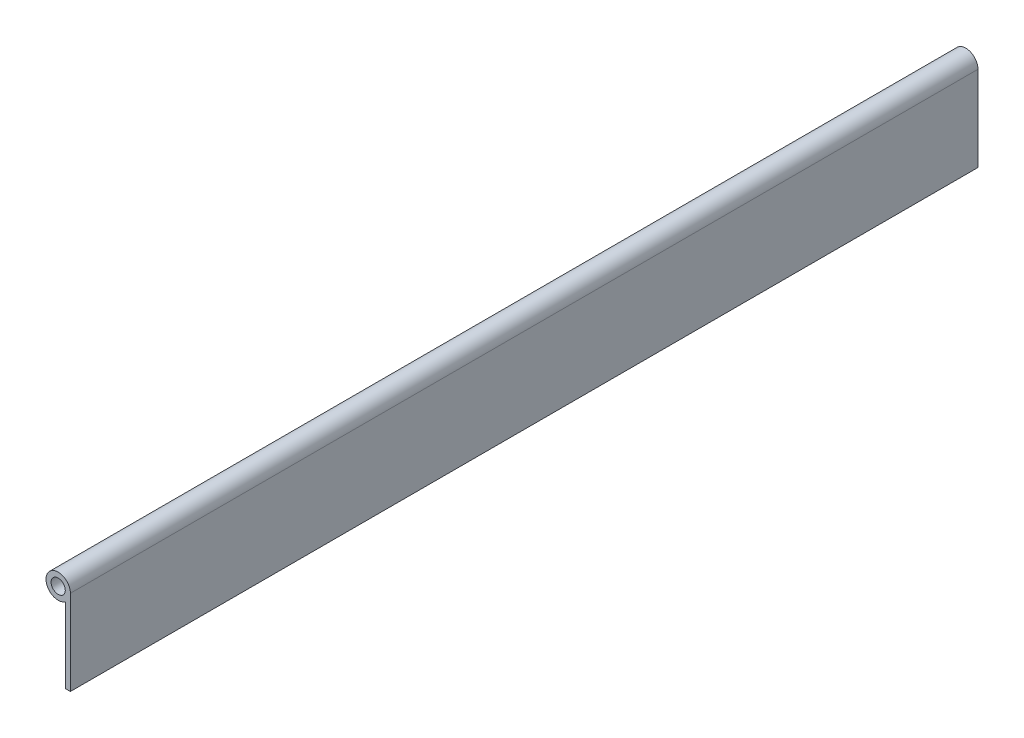
ISO-10303-21;
HEADER;
FILE_DESCRIPTION(('STEP AP214'),'2;1');
FILE_NAME('part.step','',(''),(''),'','','');
FILE_SCHEMA(('AUTOMOTIVE_DESIGN { 1 0 10303 214 1 1 1 1 }'));
ENDSEC;
DATA;
#1=APPLICATION_CONTEXT('core data for automotive mechanical design processes');
#2=APPLICATION_PROTOCOL_DEFINITION('international standard','automotive_design',2000,#1);
#3=PRODUCT_CONTEXT('',#1,'mechanical');
#4=PRODUCT('Part','Part','',(#3));
#5=PRODUCT_RELATED_PRODUCT_CATEGORY('part','',(#4));
#6=PRODUCT_DEFINITION_FORMATION('','',#4);
#7=PRODUCT_DEFINITION_CONTEXT('part definition',#1,'design');
#8=PRODUCT_DEFINITION('design','',#6,#7);
#9=PRODUCT_DEFINITION_SHAPE('','',#8);
#10=(LENGTH_UNIT() NAMED_UNIT(*) SI_UNIT(.MILLI.,.METRE.));
#11=(NAMED_UNIT(*) PLANE_ANGLE_UNIT() SI_UNIT($,.RADIAN.));
#12=(NAMED_UNIT(*) SI_UNIT($,.STERADIAN.) SOLID_ANGLE_UNIT());
#13=UNCERTAINTY_MEASURE_WITH_UNIT(LENGTH_MEASURE(1.E-05),#10,'distance_accuracy_value','');
#14=(GEOMETRIC_REPRESENTATION_CONTEXT(3) GLOBAL_UNCERTAINTY_ASSIGNED_CONTEXT((#13)) GLOBAL_UNIT_ASSIGNED_CONTEXT((#10,
#11,#12)) REPRESENTATION_CONTEXT('',''));
#15=CARTESIAN_POINT('',(0.,0.,0.));
#16=DIRECTION('',(0.,0.,1.));
#17=DIRECTION('',(1.,0.,0.));
#18=AXIS2_PLACEMENT_3D('',#15,#16,#17);
#19=CARTESIAN_POINT('',(0.,0.,406.4));
#20=DIRECTION('',(0.,0.,1.));
#21=DIRECTION('',(1.,0.,0.));
#22=AXIS2_PLACEMENT_3D('',#19,#20,#21);
#23=PLANE('',#22);
#24=CARTESIAN_POINT('',(0.,0.,406.4));
#25=DIRECTION('',(0.,0.,1.));
#26=DIRECTION('',(1.,0.,0.));
#27=AXIS2_PLACEMENT_3D('',#24,#25,#26);
#28=CIRCLE('',#27,5.461);
#29=CARTESIAN_POINT('',(5.461,0.,406.4));
#30=VERTEX_POINT('',#29);
#31=CARTESIAN_POINT('',(3.17500000000001,-4.44318534387211,406.4));
#32=VERTEX_POINT('',#31);
#33=EDGE_CURVE('E89',#30,#32,#28,.T.);
#34=ORIENTED_EDGE('',*,*,#33,.T.);
#35=DIRECTION('',(0.,-1.,0.));
#36=VECTOR('',#35,1.);
#37=CARTESIAN_POINT('',(3.17500000000001,-38.1,406.4));
#38=LINE('',#37,#36);
#39=CARTESIAN_POINT('',(3.17500000000001,-38.1,406.4));
#40=VERTEX_POINT('',#39);
#41=EDGE_CURVE('E84',#32,#40,#38,.T.);
#42=ORIENTED_EDGE('',*,*,#41,.T.);
#43=DIRECTION('',(1.,0.,0.));
#44=VECTOR('',#43,1.);
#45=CARTESIAN_POINT('',(5.461,-38.1,406.4));
#46=LINE('',#45,#44);
#47=CARTESIAN_POINT('',(5.461,-38.1,406.4));
#48=VERTEX_POINT('',#47);
#49=EDGE_CURVE('E87',#40,#48,#46,.T.);
#50=ORIENTED_EDGE('',*,*,#49,.T.);
#51=DIRECTION('',(0.,1.,0.));
#52=VECTOR('',#51,1.);
#53=CARTESIAN_POINT('',(5.461,0.,406.4));
#54=LINE('',#53,#52);
#55=EDGE_CURVE('E54',#48,#30,#54,.T.);
#56=ORIENTED_EDGE('',*,*,#55,.T.);
#57=EDGE_LOOP('',(#34,#42,#50,#56));
#58=FACE_BOUND('',#57,.T.);
#59=CARTESIAN_POINT('',(0.,0.,406.4));
#60=DIRECTION('',(0.,0.,1.));
#61=DIRECTION('',(1.,0.,0.));
#62=AXIS2_PLACEMENT_3D('',#59,#60,#61);
#63=CIRCLE('',#62,3.175);
#64=CARTESIAN_POINT('',(3.175,0.,406.4));
#65=VERTEX_POINT('',#64);
#66=EDGE_CURVE('E104',#65,#65,#63,.T.);
#67=ORIENTED_EDGE('',*,*,#66,.F.);
#68=EDGE_LOOP('',(#67));
#69=FACE_BOUND('',#68,.T.);
#70=ADVANCED_FACE('F37',(#58,#69),#23,.T.);
#71=CARTESIAN_POINT('',(0.,0.,0.));
#72=DIRECTION('',(0.,0.,1.));
#73=DIRECTION('',(1.,0.,0.));
#74=AXIS2_PLACEMENT_3D('',#71,#72,#73);
#75=PLANE('',#74);
#76=CARTESIAN_POINT('',(0.,0.,0.));
#77=DIRECTION('',(0.,0.,1.));
#78=DIRECTION('',(1.,0.,0.));
#79=AXIS2_PLACEMENT_3D('',#76,#77,#78);
#80=CIRCLE('',#79,5.461);
#81=CARTESIAN_POINT('',(5.461,0.,0.));
#82=VERTEX_POINT('',#81);
#83=CARTESIAN_POINT('',(3.17500000000001,-4.44318534387211,0.));
#84=VERTEX_POINT('',#83);
#85=EDGE_CURVE('E101',#82,#84,#80,.T.);
#86=ORIENTED_EDGE('',*,*,#85,.F.);
#87=DIRECTION('',(0.,1.,0.));
#88=VECTOR('',#87,1.);
#89=CARTESIAN_POINT('',(5.461,0.,0.));
#90=LINE('',#89,#88);
#91=CARTESIAN_POINT('',(5.461,-38.1,0.));
#92=VERTEX_POINT('',#91);
#93=EDGE_CURVE('E77',#92,#82,#90,.T.);
#94=ORIENTED_EDGE('',*,*,#93,.F.);
#95=DIRECTION('',(1.,0.,0.));
#96=VECTOR('',#95,1.);
#97=CARTESIAN_POINT('',(5.461,-38.1,0.));
#98=LINE('',#97,#96);
#99=CARTESIAN_POINT('',(3.17500000000001,-38.1,0.));
#100=VERTEX_POINT('',#99);
#101=EDGE_CURVE('E71',#100,#92,#98,.T.);
#102=ORIENTED_EDGE('',*,*,#101,.F.);
#103=DIRECTION('',(0.,-1.,0.));
#104=VECTOR('',#103,1.);
#105=CARTESIAN_POINT('',(3.17500000000001,-38.1,0.));
#106=LINE('',#105,#104);
#107=EDGE_CURVE('E93',#84,#100,#106,.T.);
#108=ORIENTED_EDGE('',*,*,#107,.F.);
#109=EDGE_LOOP('',(#86,#94,#102,#108));
#110=FACE_BOUND('',#109,.T.);
#111=CARTESIAN_POINT('',(0.,0.,0.));
#112=DIRECTION('',(0.,0.,1.));
#113=DIRECTION('',(1.,0.,0.));
#114=AXIS2_PLACEMENT_3D('',#111,#112,#113);
#115=CIRCLE('',#114,3.175);
#116=CARTESIAN_POINT('',(3.175,0.,0.));
#117=VERTEX_POINT('',#116);
#118=EDGE_CURVE('E116',#117,#117,#115,.T.);
#119=ORIENTED_EDGE('',*,*,#118,.T.);
#120=EDGE_LOOP('',(#119));
#121=FACE_BOUND('',#120,.T.);
#122=ADVANCED_FACE('F112',(#110,#121),#75,.F.);
#123=CARTESIAN_POINT('',(0.,0.,406.4));
#124=DIRECTION('',(0.,0.,-1.));
#125=DIRECTION('',(-1.,0.,0.));
#126=AXIS2_PLACEMENT_3D('',#123,#124,#125);
#127=CYLINDRICAL_SURFACE('',#126,5.461);
#128=ORIENTED_EDGE('',*,*,#85,.T.);
#129=DIRECTION('',(0.,0.,-1.));
#130=VECTOR('',#129,1.);
#131=CARTESIAN_POINT('',(3.17500000000001,-4.44318534387211,406.4));
#132=LINE('',#131,#130);
#133=EDGE_CURVE('E11',#32,#84,#132,.T.);
#134=ORIENTED_EDGE('',*,*,#133,.F.);
#135=ORIENTED_EDGE('',*,*,#33,.F.);
#136=DIRECTION('',(0.,0.,-1.));
#137=VECTOR('',#136,1.);
#138=CARTESIAN_POINT('',(5.461,0.,406.4));
#139=LINE('',#138,#137);
#140=EDGE_CURVE('E97',#30,#82,#139,.T.);
#141=ORIENTED_EDGE('',*,*,#140,.T.);
#142=EDGE_LOOP('',(#128,#134,#135,#141));
#143=FACE_BOUND('',#142,.T.);
#144=ADVANCED_FACE('F39',(#143),#127,.T.);
#145=CARTESIAN_POINT('',(3.17500000000001,-38.1,406.4));
#146=DIRECTION('',(1.,0.,0.));
#147=DIRECTION('',(0.,1.,0.));
#148=AXIS2_PLACEMENT_3D('',#145,#146,#147);
#149=PLANE('',#148);
#150=ORIENTED_EDGE('',*,*,#107,.T.);
#151=DIRECTION('',(0.,0.,-1.));
#152=VECTOR('',#151,1.);
#153=CARTESIAN_POINT('',(3.17500000000001,-38.1,406.4));
#154=LINE('',#153,#152);
#155=EDGE_CURVE('E46',#40,#100,#154,.T.);
#156=ORIENTED_EDGE('',*,*,#155,.F.);
#157=ORIENTED_EDGE('',*,*,#41,.F.);
#158=ORIENTED_EDGE('',*,*,#133,.T.);
#159=EDGE_LOOP('',(#150,#156,#157,#158));
#160=FACE_BOUND('',#159,.T.);
#161=ADVANCED_FACE('F92',(#160),#149,.F.);
#162=CARTESIAN_POINT('',(5.461,-38.1,406.4));
#163=DIRECTION('',(0.,1.,0.));
#164=DIRECTION('',(0.,0.,1.));
#165=AXIS2_PLACEMENT_3D('',#162,#163,#164);
#166=PLANE('',#165);
#167=ORIENTED_EDGE('',*,*,#101,.T.);
#168=DIRECTION('',(0.,0.,-1.));
#169=VECTOR('',#168,1.);
#170=CARTESIAN_POINT('',(5.461,-38.1,406.4));
#171=LINE('',#170,#169);
#172=EDGE_CURVE('E94',#48,#92,#171,.T.);
#173=ORIENTED_EDGE('',*,*,#172,.F.);
#174=ORIENTED_EDGE('',*,*,#49,.F.);
#175=ORIENTED_EDGE('',*,*,#155,.T.);
#176=EDGE_LOOP('',(#167,#173,#174,#175));
#177=FACE_BOUND('',#176,.T.);
#178=ADVANCED_FACE('F95',(#177),#166,.F.);
#179=CARTESIAN_POINT('',(5.461,0.,406.4));
#180=DIRECTION('',(-1.,0.,0.));
#181=DIRECTION('',(0.,-1.,0.));
#182=AXIS2_PLACEMENT_3D('',#179,#180,#181);
#183=PLANE('',#182);
#184=ORIENTED_EDGE('',*,*,#93,.T.);
#185=ORIENTED_EDGE('',*,*,#140,.F.);
#186=ORIENTED_EDGE('',*,*,#55,.F.);
#187=ORIENTED_EDGE('',*,*,#172,.T.);
#188=EDGE_LOOP('',(#184,#185,#186,#187));
#189=FACE_BOUND('',#188,.T.);
#190=ADVANCED_FACE('F109',(#189),#183,.F.);
#191=CARTESIAN_POINT('',(0.,0.,406.4));
#192=DIRECTION('',(0.,0.,-1.));
#193=DIRECTION('',(-1.,0.,0.));
#194=AXIS2_PLACEMENT_3D('',#191,#192,#193);
#195=CYLINDRICAL_SURFACE('',#194,3.175);
#196=ORIENTED_EDGE('',*,*,#66,.T.);
#197=EDGE_LOOP('',(#196));
#198=FACE_BOUND('',#197,.T.);
#199=ORIENTED_EDGE('',*,*,#118,.F.);
#200=EDGE_LOOP('',(#199));
#201=FACE_BOUND('',#200,.T.);
#202=ADVANCED_FACE('F122',(#198,#201),#195,.F.);
#203=CLOSED_SHELL('',(#70,#122,#144,#161,#178,#190,#202));
#204=MANIFOLD_SOLID_BREP('B2',#203);
#205=ADVANCED_BREP_SHAPE_REPRESENTATION('',(#18,#204),#14);
#206=SHAPE_DEFINITION_REPRESENTATION(#9,#205);
ENDSEC;
END-ISO-10303-21;
